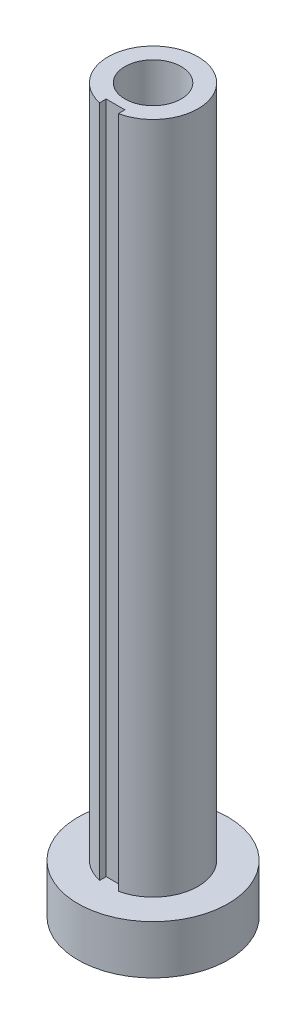
ISO-10303-21;
HEADER;
FILE_DESCRIPTION(('STEP AP214'),'2;1');
FILE_NAME('part.step','',(''),(''),'','','');
FILE_SCHEMA(('AUTOMOTIVE_DESIGN { 1 0 10303 214 1 1 1 1 }'));
ENDSEC;
DATA;
#1=APPLICATION_CONTEXT('core data for automotive mechanical design processes');
#2=APPLICATION_PROTOCOL_DEFINITION('international standard','automotive_design',2000,#1);
#3=PRODUCT_CONTEXT('',#1,'mechanical');
#4=PRODUCT('Part','Part','',(#3));
#5=PRODUCT_RELATED_PRODUCT_CATEGORY('part','',(#4));
#6=PRODUCT_DEFINITION_FORMATION('','',#4);
#7=PRODUCT_DEFINITION_CONTEXT('part definition',#1,'design');
#8=PRODUCT_DEFINITION('design','',#6,#7);
#9=PRODUCT_DEFINITION_SHAPE('','',#8);
#10=(LENGTH_UNIT() NAMED_UNIT(*) SI_UNIT(.MILLI.,.METRE.));
#11=(NAMED_UNIT(*) PLANE_ANGLE_UNIT() SI_UNIT($,.RADIAN.));
#12=(NAMED_UNIT(*) SI_UNIT($,.STERADIAN.) SOLID_ANGLE_UNIT());
#13=UNCERTAINTY_MEASURE_WITH_UNIT(LENGTH_MEASURE(1.E-05),#10,'distance_accuracy_value','');
#14=(GEOMETRIC_REPRESENTATION_CONTEXT(3) GLOBAL_UNCERTAINTY_ASSIGNED_CONTEXT((#13)) GLOBAL_UNIT_ASSIGNED_CONTEXT((#10,
#11,#12)) REPRESENTATION_CONTEXT('',''));
#15=CARTESIAN_POINT('',(0.,0.,0.));
#16=DIRECTION('',(0.,0.,1.));
#17=DIRECTION('',(1.,0.,0.));
#18=AXIS2_PLACEMENT_3D('',#15,#16,#17);
#19=CARTESIAN_POINT('',(0.,97.79,0.));
#20=DIRECTION('',(0.,-1.,0.));
#21=DIRECTION('',(0.,0.,-1.));
#22=AXIS2_PLACEMENT_3D('',#19,#20,#21);
#23=CYLINDRICAL_SURFACE('',#22,6.096);
#24=CARTESIAN_POINT('',(0.,6.604,0.));
#25=DIRECTION('',(0.,-1.,0.));
#26=DIRECTION('',(0.,0.,-1.));
#27=AXIS2_PLACEMENT_3D('',#24,#25,#26);
#28=CIRCLE('',#27,6.096);
#29=CARTESIAN_POINT('',(-1.27,6.604,5.9622408539072));
#30=VERTEX_POINT('',#29);
#31=CARTESIAN_POINT('',(1.27,6.604,5.9622408539072));
#32=VERTEX_POINT('',#31);
#33=EDGE_CURVE('E50',#30,#32,#28,.T.);
#34=ORIENTED_EDGE('',*,*,#33,.F.);
#35=DIRECTION('',(0.,-1.,0.));
#36=VECTOR('',#35,1.);
#37=CARTESIAN_POINT('',(-1.27,97.79,5.9622408539072));
#38=LINE('',#37,#36);
#39=CARTESIAN_POINT('',(-1.27,97.79,5.9622408539072));
#40=VERTEX_POINT('',#39);
#41=EDGE_CURVE('E43',#30,#40,#38,.F.);
#42=ORIENTED_EDGE('',*,*,#41,.T.);
#43=CARTESIAN_POINT('',(0.,97.79,0.));
#44=DIRECTION('',(0.,1.,0.));
#45=DIRECTION('',(0.,0.,1.));
#46=AXIS2_PLACEMENT_3D('',#43,#44,#45);
#47=CIRCLE('',#46,6.096);
#48=CARTESIAN_POINT('',(1.27,97.79,5.9622408539072));
#49=VERTEX_POINT('',#48);
#50=EDGE_CURVE('E108',#49,#40,#47,.T.);
#51=ORIENTED_EDGE('',*,*,#50,.F.);
#52=DIRECTION('',(0.,-1.,0.));
#53=VECTOR('',#52,1.);
#54=CARTESIAN_POINT('',(1.27,97.79,5.9622408539072));
#55=LINE('',#54,#53);
#56=EDGE_CURVE('E113',#49,#32,#55,.T.);
#57=ORIENTED_EDGE('',*,*,#56,.T.);
#58=EDGE_LOOP('',(#34,#42,#51,#57));
#59=FACE_BOUND('',#58,.T.);
#60=ADVANCED_FACE('F36',(#59),#23,.T.);
#61=CARTESIAN_POINT('',(-1.27,97.79,5.08));
#62=DIRECTION('',(0.,0.,-1.));
#63=DIRECTION('',(-1.,0.,0.));
#64=AXIS2_PLACEMENT_3D('',#61,#62,#63);
#65=PLANE('',#64);
#66=DIRECTION('',(-1.,0.,0.));
#67=VECTOR('',#66,1.);
#68=CARTESIAN_POINT('',(-1.27,6.604,5.08));
#69=LINE('',#68,#67);
#70=CARTESIAN_POINT('',(1.27,6.604,5.08));
#71=VERTEX_POINT('',#70);
#72=CARTESIAN_POINT('',(-1.27,6.604,5.08));
#73=VERTEX_POINT('',#72);
#74=EDGE_CURVE('E88',#71,#73,#69,.T.);
#75=ORIENTED_EDGE('',*,*,#74,.F.);
#76=DIRECTION('',(0.,-1.,0.));
#77=VECTOR('',#76,1.);
#78=CARTESIAN_POINT('',(1.27,97.79,5.08));
#79=LINE('',#78,#77);
#80=CARTESIAN_POINT('',(1.27,97.79,5.08));
#81=VERTEX_POINT('',#80);
#82=EDGE_CURVE('E76',#81,#71,#79,.T.);
#83=ORIENTED_EDGE('',*,*,#82,.F.);
#84=DIRECTION('',(1.,0.,0.));
#85=VECTOR('',#84,1.);
#86=CARTESIAN_POINT('',(-1.27,97.79,5.08));
#87=LINE('',#86,#85);
#88=CARTESIAN_POINT('',(-1.27,97.79,5.08));
#89=VERTEX_POINT('',#88);
#90=EDGE_CURVE('E101',#89,#81,#87,.T.);
#91=ORIENTED_EDGE('',*,*,#90,.F.);
#92=DIRECTION('',(0.,-1.,0.));
#93=VECTOR('',#92,1.);
#94=CARTESIAN_POINT('',(-1.27,97.79,5.08));
#95=LINE('',#94,#93);
#96=EDGE_CURVE('E85',#89,#73,#95,.T.);
#97=ORIENTED_EDGE('',*,*,#96,.T.);
#98=EDGE_LOOP('',(#75,#83,#91,#97));
#99=FACE_BOUND('',#98,.T.);
#100=ADVANCED_FACE('F89',(#99),#65,.F.);
#101=CARTESIAN_POINT('',(-1.26999999999999,97.79,6.70768167869011));
#102=DIRECTION('',(-1.,0.,0.));
#103=DIRECTION('',(0.,0.,1.));
#104=AXIS2_PLACEMENT_3D('',#101,#102,#103);
#105=PLANE('',#104);
#106=DIRECTION('',(0.,0.,1.));
#107=VECTOR('',#106,1.);
#108=CARTESIAN_POINT('',(-1.26999999999999,6.604,6.70768167869011));
#109=LINE('',#108,#107);
#110=EDGE_CURVE('E57',#73,#30,#109,.T.);
#111=ORIENTED_EDGE('',*,*,#110,.F.);
#112=ORIENTED_EDGE('',*,*,#96,.F.);
#113=DIRECTION('',(0.,0.,-1.));
#114=VECTOR('',#113,1.);
#115=CARTESIAN_POINT('',(-1.26999999999999,97.79,6.70768167869011));
#116=LINE('',#115,#114);
#117=EDGE_CURVE('E95',#40,#89,#116,.T.);
#118=ORIENTED_EDGE('',*,*,#117,.F.);
#119=ORIENTED_EDGE('',*,*,#41,.F.);
#120=EDGE_LOOP('',(#111,#112,#118,#119));
#121=FACE_BOUND('',#120,.T.);
#122=ADVANCED_FACE('F116',(#121),#105,.F.);
#123=CARTESIAN_POINT('',(1.26999999999999,97.79,6.70768167869011));
#124=DIRECTION('',(1.,0.,0.));
#125=DIRECTION('',(0.,0.,-1.));
#126=AXIS2_PLACEMENT_3D('',#123,#124,#125);
#127=PLANE('',#126);
#128=DIRECTION('',(0.,0.,-1.));
#129=VECTOR('',#128,1.);
#130=CARTESIAN_POINT('',(1.26999999999999,6.604,6.70768167869011));
#131=LINE('',#130,#129);
#132=EDGE_CURVE('E11',#32,#71,#131,.T.);
#133=ORIENTED_EDGE('',*,*,#132,.F.);
#134=ORIENTED_EDGE('',*,*,#56,.F.);
#135=DIRECTION('',(0.,0.,1.));
#136=VECTOR('',#135,1.);
#137=CARTESIAN_POINT('',(1.26999999999999,97.79,6.70768167869011));
#138=LINE('',#137,#136);
#139=EDGE_CURVE('E80',#81,#49,#138,.T.);
#140=ORIENTED_EDGE('',*,*,#139,.F.);
#141=ORIENTED_EDGE('',*,*,#82,.T.);
#142=EDGE_LOOP('',(#133,#134,#140,#141));
#143=FACE_BOUND('',#142,.T.);
#144=ADVANCED_FACE('F78',(#143),#127,.F.);
#145=CARTESIAN_POINT('',(0.,97.79,0.));
#146=DIRECTION('',(0.,1.,0.));
#147=DIRECTION('',(0.,0.,1.));
#148=AXIS2_PLACEMENT_3D('',#145,#146,#147);
#149=PLANE('',#148);
#150=ORIENTED_EDGE('',*,*,#117,.T.);
#151=ORIENTED_EDGE('',*,*,#90,.T.);
#152=ORIENTED_EDGE('',*,*,#139,.T.);
#153=ORIENTED_EDGE('',*,*,#50,.T.);
#154=EDGE_LOOP('',(#150,#151,#152,#153));
#155=FACE_BOUND('',#154,.T.);
#156=CARTESIAN_POINT('',(0.,97.79,0.));
#157=DIRECTION('',(0.,1.,0.));
#158=DIRECTION('',(0.,0.,1.));
#159=AXIS2_PLACEMENT_3D('',#156,#157,#158);
#160=CIRCLE('',#159,3.81);
#161=CARTESIAN_POINT('',(0.,97.79,3.81));
#162=VERTEX_POINT('',#161);
#163=EDGE_CURVE('E105',#162,#162,#160,.T.);
#164=ORIENTED_EDGE('',*,*,#163,.F.);
#165=EDGE_LOOP('',(#164));
#166=FACE_BOUND('',#165,.T.);
#167=ADVANCED_FACE('F118',(#155,#166),#149,.T.);
#168=CARTESIAN_POINT('',(0.,0.,0.));
#169=DIRECTION('',(0.,1.,0.));
#170=DIRECTION('',(0.,0.,1.));
#171=AXIS2_PLACEMENT_3D('',#168,#169,#170);
#172=PLANE('',#171);
#173=CARTESIAN_POINT('',(0.,0.,0.));
#174=DIRECTION('',(0.,1.,0.));
#175=DIRECTION('',(0.,0.,1.));
#176=AXIS2_PLACEMENT_3D('',#173,#174,#175);
#177=CIRCLE('',#176,3.81);
#178=CARTESIAN_POINT('',(0.,0.,3.81));
#179=VERTEX_POINT('',#178);
#180=EDGE_CURVE('E84',#179,#179,#177,.T.);
#181=ORIENTED_EDGE('',*,*,#180,.T.);
#182=EDGE_LOOP('',(#181));
#183=FACE_BOUND('',#182,.T.);
#184=CARTESIAN_POINT('',(0.,0.,0.));
#185=DIRECTION('',(0.,-1.,0.));
#186=DIRECTION('',(0.,0.,-1.));
#187=AXIS2_PLACEMENT_3D('',#184,#185,#186);
#188=CIRCLE('',#187,10.16);
#189=CARTESIAN_POINT('',(0.,0.,-10.16));
#190=VERTEX_POINT('',#189);
#191=EDGE_CURVE('E159',#190,#190,#188,.T.);
#192=ORIENTED_EDGE('',*,*,#191,.T.);
#193=EDGE_LOOP('',(#192));
#194=FACE_BOUND('',#193,.T.);
#195=ADVANCED_FACE('F121',(#183,#194),#172,.F.);
#196=CARTESIAN_POINT('',(0.,97.79,0.));
#197=DIRECTION('',(0.,-1.,0.));
#198=DIRECTION('',(0.,0.,-1.));
#199=AXIS2_PLACEMENT_3D('',#196,#197,#198);
#200=CYLINDRICAL_SURFACE('',#199,3.81);
#201=ORIENTED_EDGE('',*,*,#180,.F.);
#202=EDGE_LOOP('',(#201));
#203=FACE_BOUND('',#202,.T.);
#204=ORIENTED_EDGE('',*,*,#163,.T.);
#205=EDGE_LOOP('',(#204));
#206=FACE_BOUND('',#205,.T.);
#207=ADVANCED_FACE('F125',(#203,#206),#200,.F.);
#208=CARTESIAN_POINT('',(0.,6.604,0.));
#209=DIRECTION('',(0.,-1.,0.));
#210=DIRECTION('',(0.,0.,-1.));
#211=AXIS2_PLACEMENT_3D('',#208,#209,#210);
#212=PLANE('',#211);
#213=CARTESIAN_POINT('',(0.,6.604,0.));
#214=DIRECTION('',(0.,-1.,0.));
#215=DIRECTION('',(0.,0.,-1.));
#216=AXIS2_PLACEMENT_3D('',#213,#214,#215);
#217=CIRCLE('',#216,10.16);
#218=CARTESIAN_POINT('',(0.,6.604,-10.16));
#219=VERTEX_POINT('',#218);
#220=EDGE_CURVE('E91',#219,#219,#217,.T.);
#221=ORIENTED_EDGE('',*,*,#220,.F.);
#222=EDGE_LOOP('',(#221));
#223=FACE_BOUND('',#222,.T.);
#224=ORIENTED_EDGE('',*,*,#74,.T.);
#225=ORIENTED_EDGE('',*,*,#110,.T.);
#226=ORIENTED_EDGE('',*,*,#33,.T.);
#227=ORIENTED_EDGE('',*,*,#132,.T.);
#228=EDGE_LOOP('',(#224,#225,#226,#227));
#229=FACE_BOUND('',#228,.T.);
#230=ADVANCED_FACE('F93',(#223,#229),#212,.F.);
#231=CARTESIAN_POINT('',(0.,6.604,0.));
#232=DIRECTION('',(0.,-1.,0.));
#233=DIRECTION('',(0.,0.,-1.));
#234=AXIS2_PLACEMENT_3D('',#231,#232,#233);
#235=CYLINDRICAL_SURFACE('',#234,10.16);
#236=ORIENTED_EDGE('',*,*,#220,.T.);
#237=EDGE_LOOP('',(#236));
#238=FACE_BOUND('',#237,.T.);
#239=ORIENTED_EDGE('',*,*,#191,.F.);
#240=EDGE_LOOP('',(#239));
#241=FACE_BOUND('',#240,.T.);
#242=ADVANCED_FACE('F133',(#238,#241),#235,.T.);
#243=CLOSED_SHELL('',(#60,#100,#122,#144,#167,#195,#207,#230,#242));
#244=MANIFOLD_SOLID_BREP('B2',#243);
#245=ADVANCED_BREP_SHAPE_REPRESENTATION('',(#18,#244),#14);
#246=SHAPE_DEFINITION_REPRESENTATION(#9,#245);
ENDSEC;
END-ISO-10303-21;
